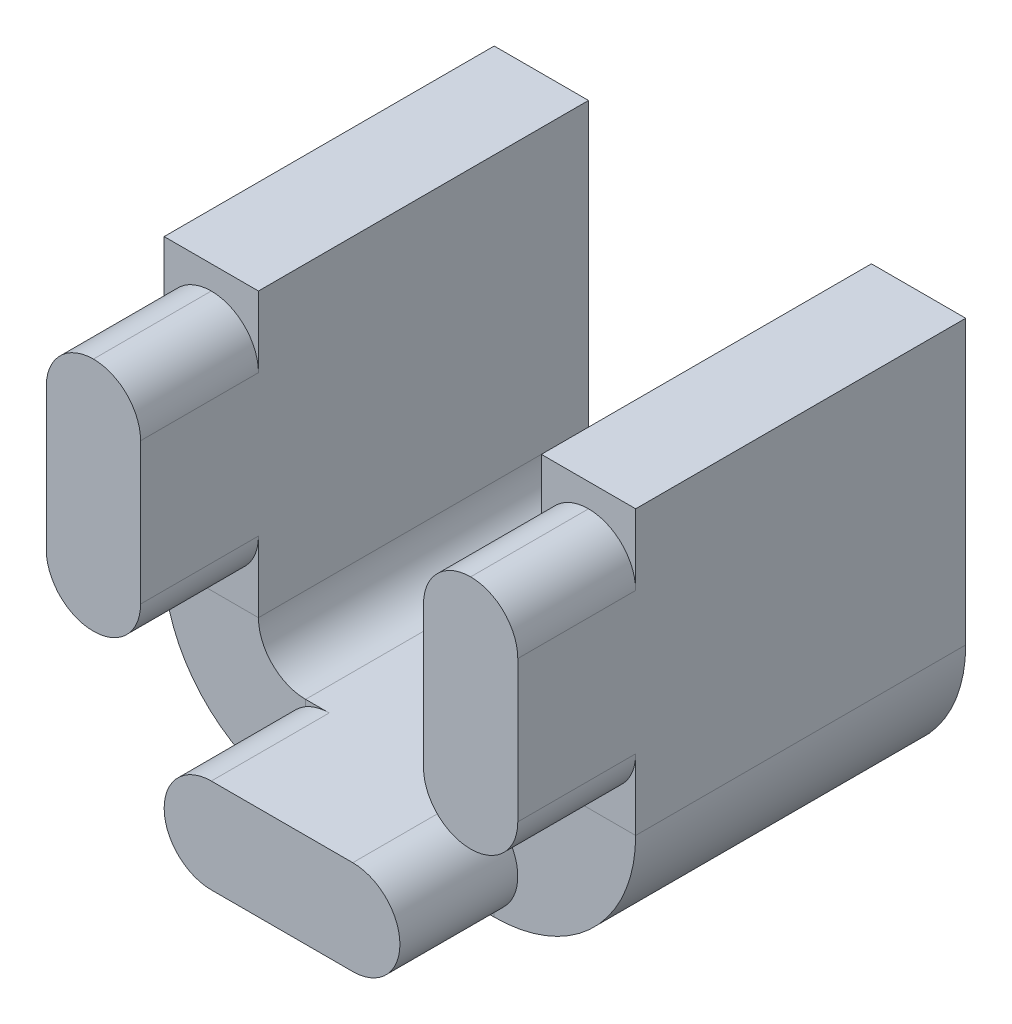
ISO-10303-21;
HEADER;
FILE_DESCRIPTION(('STEP AP214'),'2;1');
FILE_NAME('part.step','',(''),(''),'','','');
FILE_SCHEMA(('AUTOMOTIVE_DESIGN { 1 0 10303 214 1 1 1 1 }'));
ENDSEC;
DATA;
#1=APPLICATION_CONTEXT('core data for automotive mechanical design processes');
#2=APPLICATION_PROTOCOL_DEFINITION('international standard','automotive_design',2000,#1);
#3=PRODUCT_CONTEXT('',#1,'mechanical');
#4=PRODUCT('Part','Part','',(#3));
#5=PRODUCT_RELATED_PRODUCT_CATEGORY('part','',(#4));
#6=PRODUCT_DEFINITION_FORMATION('','',#4);
#7=PRODUCT_DEFINITION_CONTEXT('part definition',#1,'design');
#8=PRODUCT_DEFINITION('design','',#6,#7);
#9=PRODUCT_DEFINITION_SHAPE('','',#8);
#10=(LENGTH_UNIT() NAMED_UNIT(*) SI_UNIT(.MILLI.,.METRE.));
#11=(NAMED_UNIT(*) PLANE_ANGLE_UNIT() SI_UNIT($,.RADIAN.));
#12=(NAMED_UNIT(*) SI_UNIT($,.STERADIAN.) SOLID_ANGLE_UNIT());
#13=UNCERTAINTY_MEASURE_WITH_UNIT(LENGTH_MEASURE(1.E-05),#10,'distance_accuracy_value','');
#14=(GEOMETRIC_REPRESENTATION_CONTEXT(3) GLOBAL_UNCERTAINTY_ASSIGNED_CONTEXT((#13)) GLOBAL_UNIT_ASSIGNED_CONTEXT((#10,
#11,#12)) REPRESENTATION_CONTEXT('',''));
#15=CARTESIAN_POINT('',(0.,0.,0.));
#16=DIRECTION('',(0.,0.,1.));
#17=DIRECTION('',(1.,0.,0.));
#18=AXIS2_PLACEMENT_3D('',#15,#16,#17);
#19=CARTESIAN_POINT('',(-3.,0.,3.5));
#20=DIRECTION('',(0.,-1.,0.));
#21=DIRECTION('',(0.,0.,-1.));
#22=AXIS2_PLACEMENT_3D('',#19,#20,#21);
#23=PLANE('',#22);
#24=DIRECTION('',(0.,0.,-1.));
#25=VECTOR('',#24,1.);
#26=CARTESIAN_POINT('',(-2.00000000000002,0.,-3.5));
#27=LINE('',#26,#25);
#28=CARTESIAN_POINT('',(-2.00000000000002,0.,3.5));
#29=VERTEX_POINT('',#28);
#30=CARTESIAN_POINT('',(-2.00000000000002,0.,-3.5));
#31=VERTEX_POINT('',#30);
#32=EDGE_CURVE('E330',#29,#31,#27,.T.);
#33=ORIENTED_EDGE('',*,*,#32,.F.);
#34=DIRECTION('',(-1.,0.,0.));
#35=VECTOR('',#34,1.);
#36=CARTESIAN_POINT('',(-3.,0.,3.5));
#37=LINE('',#36,#35);
#38=CARTESIAN_POINT('',(-1.5,0.,3.5));
#39=VERTEX_POINT('',#38);
#40=EDGE_CURVE('E326',#39,#29,#37,.T.);
#41=ORIENTED_EDGE('',*,*,#40,.F.);
#42=DIRECTION('',(0.,0.,-1.));
#43=VECTOR('',#42,1.);
#44=CARTESIAN_POINT('',(-1.5,0.,6.));
#45=LINE('',#44,#43);
#46=CARTESIAN_POINT('',(-1.5,0.,6.));
#47=VERTEX_POINT('',#46);
#48=EDGE_CURVE('E664',#47,#39,#45,.T.);
#49=ORIENTED_EDGE('',*,*,#48,.F.);
#50=DIRECTION('',(-1.,0.,0.));
#51=VECTOR('',#50,1.);
#52=CARTESIAN_POINT('',(1.5,0.,6.));
#53=LINE('',#52,#51);
#54=CARTESIAN_POINT('',(1.5,0.,6.));
#55=VERTEX_POINT('',#54);
#56=EDGE_CURVE('E259',#55,#47,#53,.T.);
#57=ORIENTED_EDGE('',*,*,#56,.F.);
#58=DIRECTION('',(0.,0.,-1.));
#59=VECTOR('',#58,1.);
#60=CARTESIAN_POINT('',(1.5,0.,6.));
#61=LINE('',#60,#59);
#62=CARTESIAN_POINT('',(1.5,0.,3.5));
#63=VERTEX_POINT('',#62);
#64=EDGE_CURVE('E271',#55,#63,#61,.T.);
#65=ORIENTED_EDGE('',*,*,#64,.T.);
#66=CARTESIAN_POINT('',(2.00000000000002,0.,3.5));
#67=VERTEX_POINT('',#66);
#68=EDGE_CURVE('E327',#67,#63,#37,.T.);
#69=ORIENTED_EDGE('',*,*,#68,.F.);
#70=DIRECTION('',(0.,0.,1.));
#71=VECTOR('',#70,1.);
#72=CARTESIAN_POINT('',(2.00000000000002,0.,3.5));
#73=LINE('',#72,#71);
#74=CARTESIAN_POINT('',(2.00000000000002,0.,-3.5));
#75=VERTEX_POINT('',#74);
#76=EDGE_CURVE('E346',#75,#67,#73,.T.);
#77=ORIENTED_EDGE('',*,*,#76,.F.);
#78=DIRECTION('',(-1.,0.,0.));
#79=VECTOR('',#78,1.);
#80=CARTESIAN_POINT('',(-3.,0.,-3.5));
#81=LINE('',#80,#79);
#82=EDGE_CURVE('E323',#75,#31,#81,.T.);
#83=ORIENTED_EDGE('',*,*,#82,.T.);
#84=EDGE_LOOP('',(#33,#41,#49,#57,#65,#69,#77,#83));
#85=FACE_BOUND('',#84,.T.);
#86=CARTESIAN_POINT('',(0.,0.,0.));
#87=DIRECTION('',(0.,-1.,0.));
#88=DIRECTION('',(0.,0.,-1.));
#89=AXIS2_PLACEMENT_3D('',#86,#87,#88);
#90=CIRCLE('',#89,1.75);
#91=CARTESIAN_POINT('',(0.,0.,-1.75));
#92=VERTEX_POINT('',#91);
#93=EDGE_CURVE('E12',#92,#92,#90,.F.);
#94=ORIENTED_EDGE('',*,*,#93,.F.);
#95=EDGE_LOOP('',(#94));
#96=FACE_BOUND('',#95,.T.);
#97=ADVANCED_FACE('F44',(#85,#96),#23,.F.);
#98=CARTESIAN_POINT('',(-3.,16.1245154965971,3.5));
#99=DIRECTION('',(0.,0.,1.));
#100=DIRECTION('',(1.,0.,0.));
#101=AXIS2_PLACEMENT_3D('',#98,#99,#100);
#102=PLANE('',#101);
#103=DIRECTION('',(1.,0.,0.));
#104=VECTOR('',#103,1.);
#105=CARTESIAN_POINT('',(-3.,-2.,3.5));
#106=LINE('',#105,#104);
#107=CARTESIAN_POINT('',(-1.5,-2.,3.5));
#108=VERTEX_POINT('',#107);
#109=CARTESIAN_POINT('',(-2.00000000000002,-2.,3.5));
#110=VERTEX_POINT('',#109);
#111=EDGE_CURVE('E317',#108,#110,#106,.F.);
#112=ORIENTED_EDGE('',*,*,#111,.F.);
#113=CARTESIAN_POINT('',(-1.5,-1.,3.5));
#114=DIRECTION('',(0.,0.,1.));
#115=DIRECTION('',(-1.,0.,0.));
#116=AXIS2_PLACEMENT_3D('',#113,#114,#115);
#117=CIRCLE('',#116,1.);
#118=CARTESIAN_POINT('',(-2.00000000000002,-1.86602540378443,3.5));
#119=VERTEX_POINT('',#118);
#120=EDGE_CURVE('E265',#119,#108,#117,.T.);
#121=ORIENTED_EDGE('',*,*,#120,.F.);
#122=DIRECTION('',(0.,-1.,0.));
#123=VECTOR('',#122,1.);
#124=CARTESIAN_POINT('',(-2.00000000000002,16.1245154965971,3.5));
#125=LINE('',#124,#123);
#126=EDGE_CURVE('E340',#119,#110,#125,.T.);
#127=ORIENTED_EDGE('',*,*,#126,.T.);
#128=EDGE_LOOP('',(#112,#121,#127));
#129=FACE_BOUND('',#128,.T.);
#130=ADVANCED_FACE('F565',(#129),#102,.T.);
#131=CARTESIAN_POINT('',(-2.00000000000002,-0.133974596215571,3.5));
#132=VERTEX_POINT('',#131);
#133=EDGE_CURVE('E341',#29,#132,#125,.T.);
#134=ORIENTED_EDGE('',*,*,#133,.T.);
#135=EDGE_CURVE('E59',#39,#132,#117,.T.);
#136=ORIENTED_EDGE('',*,*,#135,.F.);
#137=ORIENTED_EDGE('',*,*,#40,.T.);
#138=EDGE_LOOP('',(#134,#136,#137));
#139=FACE_BOUND('',#138,.T.);
#140=ADVANCED_FACE('F570',(#139),#102,.T.);
#141=DIRECTION('',(0.,-1.,0.));
#142=VECTOR('',#141,1.);
#143=CARTESIAN_POINT('',(2.00000000000002,16.1245154965971,3.5));
#144=LINE('',#143,#142);
#145=CARTESIAN_POINT('',(2.00000000000002,-1.86602540378443,3.5));
#146=VERTEX_POINT('',#145);
#147=CARTESIAN_POINT('',(2.00000000000002,-2.,3.5));
#148=VERTEX_POINT('',#147);
#149=EDGE_CURVE('E336',#146,#148,#144,.T.);
#150=ORIENTED_EDGE('',*,*,#149,.F.);
#151=CARTESIAN_POINT('',(1.5,-1.,3.5));
#152=DIRECTION('',(0.,0.,1.));
#153=DIRECTION('',(1.,0.,0.));
#154=AXIS2_PLACEMENT_3D('',#151,#152,#153);
#155=CIRCLE('',#154,1.);
#156=CARTESIAN_POINT('',(1.5,-2.,3.5));
#157=VERTEX_POINT('',#156);
#158=EDGE_CURVE('E261',#157,#146,#155,.T.);
#159=ORIENTED_EDGE('',*,*,#158,.F.);
#160=EDGE_CURVE('E318',#148,#157,#106,.F.);
#161=ORIENTED_EDGE('',*,*,#160,.F.);
#162=EDGE_LOOP('',(#150,#159,#161));
#163=FACE_BOUND('',#162,.T.);
#164=ADVANCED_FACE('F491',(#163),#102,.T.);
#165=ORIENTED_EDGE('',*,*,#68,.T.);
#166=CARTESIAN_POINT('',(2.00000000000002,-0.133974596215571,3.5));
#167=VERTEX_POINT('',#166);
#168=EDGE_CURVE('E669',#167,#63,#155,.T.);
#169=ORIENTED_EDGE('',*,*,#168,.F.);
#170=EDGE_CURVE('E337',#67,#167,#144,.T.);
#171=ORIENTED_EDGE('',*,*,#170,.F.);
#172=EDGE_LOOP('',(#165,#169,#171));
#173=FACE_BOUND('',#172,.T.);
#174=ADVANCED_FACE('F573',(#173),#102,.T.);
#175=CARTESIAN_POINT('',(2.00000000000002,0.999999999999983,3.5));
#176=DIRECTION('',(0.,0.,1.));
#177=DIRECTION('',(1.,0.,0.));
#178=AXIS2_PLACEMENT_3D('',#175,#176,#177);
#179=PLANE('',#178);
#180=ORIENTED_EDGE('',*,*,#170,.T.);
#181=CARTESIAN_POINT('',(1.5,-1.,3.5));
#182=DIRECTION('',(0.,0.,1.));
#183=DIRECTION('',(1.,0.,0.));
#184=AXIS2_PLACEMENT_3D('',#181,#182,#183);
#185=CIRCLE('',#184,1.);
#186=EDGE_CURVE('E52',#167,#146,#185,.F.);
#187=ORIENTED_EDGE('',*,*,#186,.T.);
#188=ORIENTED_EDGE('',*,*,#149,.T.);
#189=CARTESIAN_POINT('',(2.00000000000002,0.999999999999983,3.5));
#190=DIRECTION('',(0.,0.,-1.));
#191=DIRECTION('',(-1.,0.,0.));
#192=AXIS2_PLACEMENT_3D('',#189,#190,#191);
#193=CIRCLE('',#192,2.99999999999998);
#194=CARTESIAN_POINT('',(5.,0.999999999999984,3.5));
#195=VERTEX_POINT('',#194);
#196=EDGE_CURVE('E304',#195,#148,#193,.T.);
#197=ORIENTED_EDGE('',*,*,#196,.F.);
#198=DIRECTION('',(1.,0.,0.));
#199=VECTOR('',#198,1.);
#200=CARTESIAN_POINT('',(-15.4390889145858,0.999999999999982,3.5));
#201=LINE('',#200,#199);
#202=CARTESIAN_POINT('',(3.,0.999999999999981,3.5));
#203=VERTEX_POINT('',#202);
#204=EDGE_CURVE('E371',#203,#195,#201,.T.);
#205=ORIENTED_EDGE('',*,*,#204,.F.);
#206=CARTESIAN_POINT('',(2.00000000000002,0.999999999999983,3.5));
#207=DIRECTION('',(0.,0.,-1.));
#208=DIRECTION('',(-1.,0.,0.));
#209=AXIS2_PLACEMENT_3D('',#206,#207,#208);
#210=CIRCLE('',#209,0.999999999999983);
#211=EDGE_CURVE('E300',#203,#67,#210,.T.);
#212=ORIENTED_EDGE('',*,*,#211,.T.);
#213=EDGE_LOOP('',(#180,#187,#188,#197,#205,#212));
#214=FACE_BOUND('',#213,.T.);
#215=ADVANCED_FACE('F483',(#214),#179,.T.);
#216=CARTESIAN_POINT('',(-2.00000000000002,0.999999999999983,3.5));
#217=DIRECTION('',(0.,0.,1.));
#218=DIRECTION('',(1.,0.,0.));
#219=AXIS2_PLACEMENT_3D('',#216,#217,#218);
#220=PLANE('',#219);
#221=ORIENTED_EDGE('',*,*,#126,.F.);
#222=CARTESIAN_POINT('',(-1.5,-1.,3.5));
#223=DIRECTION('',(0.,0.,1.));
#224=DIRECTION('',(1.,0.,0.));
#225=AXIS2_PLACEMENT_3D('',#222,#223,#224);
#226=CIRCLE('',#225,1.);
#227=EDGE_CURVE('E477',#119,#132,#226,.F.);
#228=ORIENTED_EDGE('',*,*,#227,.T.);
#229=ORIENTED_EDGE('',*,*,#133,.F.);
#230=CARTESIAN_POINT('',(-2.00000000000002,0.999999999999983,3.5));
#231=DIRECTION('',(0.,0.,1.));
#232=DIRECTION('',(1.,0.,0.));
#233=AXIS2_PLACEMENT_3D('',#230,#231,#232);
#234=CIRCLE('',#233,0.999999999999983);
#235=CARTESIAN_POINT('',(-3.,0.999999999999983,3.5));
#236=VERTEX_POINT('',#235);
#237=EDGE_CURVE('E297',#29,#236,#234,.F.);
#238=ORIENTED_EDGE('',*,*,#237,.T.);
#239=DIRECTION('',(-1.,0.,0.));
#240=VECTOR('',#239,1.);
#241=CARTESIAN_POINT('',(15.4390889145858,0.999999999999982,3.5));
#242=LINE('',#241,#240);
#243=CARTESIAN_POINT('',(-5.,0.999999999999983,3.5));
#244=VERTEX_POINT('',#243);
#245=EDGE_CURVE('E355',#236,#244,#242,.T.);
#246=ORIENTED_EDGE('',*,*,#245,.T.);
#247=CARTESIAN_POINT('',(-2.00000000000002,0.999999999999983,3.5));
#248=DIRECTION('',(0.,0.,1.));
#249=DIRECTION('',(1.,0.,0.));
#250=AXIS2_PLACEMENT_3D('',#247,#248,#249);
#251=CIRCLE('',#250,2.99999999999998);
#252=EDGE_CURVE('E296',#110,#244,#251,.F.);
#253=ORIENTED_EDGE('',*,*,#252,.F.);
#254=EDGE_LOOP('',(#221,#228,#229,#238,#246,#253));
#255=FACE_BOUND('',#254,.T.);
#256=ADVANCED_FACE('F660',(#255),#220,.T.);
#257=CARTESIAN_POINT('',(-15.4390889145858,0.,3.5));
#258=DIRECTION('',(0.,0.,1.));
#259=DIRECTION('',(0.,1.,0.));
#260=AXIS2_PLACEMENT_3D('',#257,#258,#259);
#261=PLANE('',#260);
#262=CARTESIAN_POINT('',(4.,2.5,3.5));
#263=DIRECTION('',(0.,0.,1.));
#264=DIRECTION('',(1.,0.,0.));
#265=AXIS2_PLACEMENT_3D('',#262,#263,#264);
#266=CIRCLE('',#265,1.);
#267=CARTESIAN_POINT('',(5.,2.5,3.5));
#268=VERTEX_POINT('',#267);
#269=CARTESIAN_POINT('',(4.,1.5,3.5));
#270=VERTEX_POINT('',#269);
#271=EDGE_CURVE('E67',#268,#270,#266,.F.);
#272=ORIENTED_EDGE('',*,*,#271,.T.);
#273=CARTESIAN_POINT('',(4.,2.5,3.5));
#274=DIRECTION('',(0.,0.,1.));
#275=DIRECTION('',(1.,0.,0.));
#276=AXIS2_PLACEMENT_3D('',#273,#274,#275);
#277=CIRCLE('',#276,1.);
#278=CARTESIAN_POINT('',(3.,2.5,3.5));
#279=VERTEX_POINT('',#278);
#280=EDGE_CURVE('E472',#270,#279,#277,.F.);
#281=ORIENTED_EDGE('',*,*,#280,.T.);
#282=DIRECTION('',(0.,-1.,0.));
#283=VECTOR('',#282,1.);
#284=CARTESIAN_POINT('',(3.,0.,3.5));
#285=LINE('',#284,#283);
#286=EDGE_CURVE('E370',#279,#203,#285,.T.);
#287=ORIENTED_EDGE('',*,*,#286,.T.);
#288=ORIENTED_EDGE('',*,*,#204,.T.);
#289=DIRECTION('',(0.,1.,0.));
#290=VECTOR('',#289,1.);
#291=CARTESIAN_POINT('',(5.,0.,3.5));
#292=LINE('',#291,#290);
#293=EDGE_CURVE('E367',#268,#195,#292,.F.);
#294=ORIENTED_EDGE('',*,*,#293,.F.);
#295=EDGE_LOOP('',(#272,#281,#287,#288,#294));
#296=FACE_BOUND('',#295,.T.);
#297=ADVANCED_FACE('F520',(#296),#261,.T.);
#298=CARTESIAN_POINT('',(15.4390889145858,0.,3.5));
#299=DIRECTION('',(0.,0.,1.));
#300=DIRECTION('',(0.,-1.,0.));
#301=AXIS2_PLACEMENT_3D('',#298,#299,#300);
#302=PLANE('',#301);
#303=DIRECTION('',(0.,-1.,0.));
#304=VECTOR('',#303,1.);
#305=CARTESIAN_POINT('',(-5.,0.,3.5));
#306=LINE('',#305,#304);
#307=CARTESIAN_POINT('',(-5.,7.,3.5));
#308=VERTEX_POINT('',#307);
#309=CARTESIAN_POINT('',(-5.,5.5,3.5));
#310=VERTEX_POINT('',#309);
#311=EDGE_CURVE('E395',#308,#310,#306,.T.);
#312=ORIENTED_EDGE('',*,*,#311,.T.);
#313=CARTESIAN_POINT('',(-4.,5.5,3.5));
#314=DIRECTION('',(0.,0.,1.));
#315=DIRECTION('',(1.,0.,0.));
#316=AXIS2_PLACEMENT_3D('',#313,#314,#315);
#317=CIRCLE('',#316,1.);
#318=CARTESIAN_POINT('',(-4.,6.5,3.5));
#319=VERTEX_POINT('',#318);
#320=EDGE_CURVE('E445',#310,#319,#317,.F.);
#321=ORIENTED_EDGE('',*,*,#320,.T.);
#322=CARTESIAN_POINT('',(-4.,5.5,3.5));
#323=DIRECTION('',(0.,0.,1.));
#324=DIRECTION('',(1.,0.,0.));
#325=AXIS2_PLACEMENT_3D('',#322,#323,#324);
#326=CIRCLE('',#325,1.);
#327=CARTESIAN_POINT('',(-3.,5.5,3.5));
#328=VERTEX_POINT('',#327);
#329=EDGE_CURVE('E442',#319,#328,#326,.F.);
#330=ORIENTED_EDGE('',*,*,#329,.T.);
#331=DIRECTION('',(0.,-1.,0.));
#332=VECTOR('',#331,1.);
#333=CARTESIAN_POINT('',(-3.,0.,3.5));
#334=LINE('',#333,#332);
#335=CARTESIAN_POINT('',(-3.,7.,3.5));
#336=VERTEX_POINT('',#335);
#337=EDGE_CURVE('E392',#336,#328,#334,.T.);
#338=ORIENTED_EDGE('',*,*,#337,.F.);
#339=DIRECTION('',(-1.,0.,0.));
#340=VECTOR('',#339,1.);
#341=CARTESIAN_POINT('',(15.4390889145858,7.,3.5));
#342=LINE('',#341,#340);
#343=EDGE_CURVE('E398',#336,#308,#342,.T.);
#344=ORIENTED_EDGE('',*,*,#343,.T.);
#345=EDGE_LOOP('',(#312,#321,#330,#338,#344));
#346=FACE_BOUND('',#345,.T.);
#347=ADVANCED_FACE('F608',(#346),#302,.T.);
#348=CARTESIAN_POINT('',(-3.,-2.,3.5));
#349=DIRECTION('',(0.,-1.,0.));
#350=DIRECTION('',(0.,0.,-1.));
#351=AXIS2_PLACEMENT_3D('',#348,#349,#350);
#352=PLANE('',#351);
#353=ORIENTED_EDGE('',*,*,#160,.T.);
#354=DIRECTION('',(0.,0.,-1.));
#355=VECTOR('',#354,1.);
#356=CARTESIAN_POINT('',(1.5,-2.,6.));
#357=LINE('',#356,#355);
#358=CARTESIAN_POINT('',(1.5,-2.,6.));
#359=VERTEX_POINT('',#358);
#360=EDGE_CURVE('E250',#359,#157,#357,.T.);
#361=ORIENTED_EDGE('',*,*,#360,.F.);
#362=DIRECTION('',(1.,0.,0.));
#363=VECTOR('',#362,1.);
#364=CARTESIAN_POINT('',(-1.5,-2.,6.));
#365=LINE('',#364,#363);
#366=CARTESIAN_POINT('',(-1.5,-2.,6.));
#367=VERTEX_POINT('',#366);
#368=EDGE_CURVE('E242',#367,#359,#365,.T.);
#369=ORIENTED_EDGE('',*,*,#368,.F.);
#370=DIRECTION('',(0.,0.,-1.));
#371=VECTOR('',#370,1.);
#372=CARTESIAN_POINT('',(-1.5,-2.,6.));
#373=LINE('',#372,#371);
#374=EDGE_CURVE('E248',#367,#108,#373,.T.);
#375=ORIENTED_EDGE('',*,*,#374,.T.);
#376=ORIENTED_EDGE('',*,*,#111,.T.);
#377=DIRECTION('',(0.,0.,-1.));
#378=VECTOR('',#377,1.);
#379=CARTESIAN_POINT('',(-2.00000000000002,-2.,-3.5));
#380=LINE('',#379,#378);
#381=CARTESIAN_POINT('',(-2.00000000000002,-2.,-3.5));
#382=VERTEX_POINT('',#381);
#383=EDGE_CURVE('E320',#110,#382,#380,.T.);
#384=ORIENTED_EDGE('',*,*,#383,.T.);
#385=DIRECTION('',(1.,0.,0.));
#386=VECTOR('',#385,1.);
#387=CARTESIAN_POINT('',(-3.,-2.,-3.5));
#388=LINE('',#387,#386);
#389=CARTESIAN_POINT('',(2.00000000000002,-2.,-3.5));
#390=VERTEX_POINT('',#389);
#391=EDGE_CURVE('E311',#390,#382,#388,.F.);
#392=ORIENTED_EDGE('',*,*,#391,.F.);
#393=DIRECTION('',(0.,0.,1.));
#394=VECTOR('',#393,1.);
#395=CARTESIAN_POINT('',(2.00000000000002,-2.,3.5));
#396=LINE('',#395,#394);
#397=EDGE_CURVE('E349',#390,#148,#396,.T.);
#398=ORIENTED_EDGE('',*,*,#397,.T.);
#399=EDGE_LOOP('',(#353,#361,#369,#375,#376,#384,#392,#398));
#400=FACE_BOUND('',#399,.T.);
#401=CARTESIAN_POINT('',(0.,-2.,0.));
#402=DIRECTION('',(0.,-1.,0.));
#403=DIRECTION('',(0.,0.,-1.));
#404=AXIS2_PLACEMENT_3D('',#401,#402,#403);
#405=CIRCLE('',#404,1.5);
#406=CARTESIAN_POINT('',(0.,-2.,-1.5));
#407=VERTEX_POINT('',#406);
#408=EDGE_CURVE('E285',#407,#407,#405,.F.);
#409=ORIENTED_EDGE('',*,*,#408,.T.);
#410=EDGE_LOOP('',(#409));
#411=FACE_BOUND('',#410,.T.);
#412=ADVANCED_FACE('F245',(#400,#411),#352,.T.);
#413=CARTESIAN_POINT('',(15.4390889145858,7.,3.5));
#414=DIRECTION('',(0.,1.,0.));
#415=DIRECTION('',(-1.,0.,0.));
#416=AXIS2_PLACEMENT_3D('',#413,#414,#415);
#417=PLANE('',#416);
#418=DIRECTION('',(-1.,0.,0.));
#419=VECTOR('',#418,1.);
#420=CARTESIAN_POINT('',(15.4390889145858,7.,-3.5));
#421=LINE('',#420,#419);
#422=CARTESIAN_POINT('',(-3.,7.,-3.5));
#423=VERTEX_POINT('',#422);
#424=CARTESIAN_POINT('',(-5.,7.,-3.5));
#425=VERTEX_POINT('',#424);
#426=EDGE_CURVE('E410',#423,#425,#421,.T.);
#427=ORIENTED_EDGE('',*,*,#426,.T.);
#428=DIRECTION('',(0.,0.,-1.));
#429=VECTOR('',#428,1.);
#430=CARTESIAN_POINT('',(-5.,7.,3.5));
#431=LINE('',#430,#429);
#432=EDGE_CURVE('E401',#308,#425,#431,.T.);
#433=ORIENTED_EDGE('',*,*,#432,.F.);
#434=ORIENTED_EDGE('',*,*,#343,.F.);
#435=DIRECTION('',(0.,0.,-1.));
#436=VECTOR('',#435,1.);
#437=CARTESIAN_POINT('',(-3.,7.,3.5));
#438=LINE('',#437,#436);
#439=EDGE_CURVE('E408',#336,#423,#438,.T.);
#440=ORIENTED_EDGE('',*,*,#439,.T.);
#441=EDGE_LOOP('',(#427,#433,#434,#440));
#442=FACE_BOUND('',#441,.T.);
#443=ADVANCED_FACE('F592',(#442),#417,.T.);
#444=CARTESIAN_POINT('',(15.4390889145858,0.,-3.5));
#445=DIRECTION('',(0.,0.,1.));
#446=DIRECTION('',(0.,-1.,0.));
#447=AXIS2_PLACEMENT_3D('',#444,#445,#446);
#448=PLANE('',#447);
#449=DIRECTION('',(0.,1.,0.));
#450=VECTOR('',#449,1.);
#451=CARTESIAN_POINT('',(-5.,0.,-3.5));
#452=LINE('',#451,#450);
#453=CARTESIAN_POINT('',(-5.,0.999999999999984,-3.5));
#454=VERTEX_POINT('',#453);
#455=EDGE_CURVE('E405',#454,#425,#452,.T.);
#456=ORIENTED_EDGE('',*,*,#455,.T.);
#457=ORIENTED_EDGE('',*,*,#426,.F.);
#458=DIRECTION('',(0.,1.,0.));
#459=VECTOR('',#458,1.);
#460=CARTESIAN_POINT('',(-3.,0.,-3.5));
#461=LINE('',#460,#459);
#462=CARTESIAN_POINT('',(-3.,0.999999999999982,-3.5));
#463=VERTEX_POINT('',#462);
#464=EDGE_CURVE('E385',#463,#423,#461,.T.);
#465=ORIENTED_EDGE('',*,*,#464,.F.);
#466=DIRECTION('',(-1.,0.,0.));
#467=VECTOR('',#466,1.);
#468=CARTESIAN_POINT('',(15.4390889145858,0.999999999999982,-3.5));
#469=LINE('',#468,#467);
#470=EDGE_CURVE('E403',#463,#454,#469,.T.);
#471=ORIENTED_EDGE('',*,*,#470,.T.);
#472=EDGE_LOOP('',(#456,#457,#465,#471));
#473=FACE_BOUND('',#472,.T.);
#474=ADVANCED_FACE('F595',(#473),#448,.F.);
#475=CARTESIAN_POINT('',(-5.,0.,3.5));
#476=DIRECTION('',(-1.,0.,0.));
#477=DIRECTION('',(0.,0.,1.));
#478=AXIS2_PLACEMENT_3D('',#475,#476,#477);
#479=PLANE('',#478);
#480=CARTESIAN_POINT('',(-5.,2.5,3.5));
#481=VERTEX_POINT('',#480);
#482=EDGE_CURVE('E397',#481,#244,#306,.T.);
#483=ORIENTED_EDGE('',*,*,#482,.F.);
#484=DIRECTION('',(0.,0.,1.));
#485=VECTOR('',#484,1.);
#486=CARTESIAN_POINT('',(-5.,2.5,3.5));
#487=LINE('',#486,#485);
#488=CARTESIAN_POINT('',(-5.,2.5,6.));
#489=VERTEX_POINT('',#488);
#490=EDGE_CURVE('E420',#481,#489,#487,.T.);
#491=ORIENTED_EDGE('',*,*,#490,.T.);
#492=DIRECTION('',(0.,1.,0.));
#493=VECTOR('',#492,1.);
#494=CARTESIAN_POINT('',(-5.,6.5,6.));
#495=LINE('',#494,#493);
#496=CARTESIAN_POINT('',(-5.,5.5,6.));
#497=VERTEX_POINT('',#496);
#498=EDGE_CURVE('E286',#489,#497,#495,.T.);
#499=ORIENTED_EDGE('',*,*,#498,.T.);
#500=DIRECTION('',(0.,0.,-1.));
#501=VECTOR('',#500,1.);
#502=CARTESIAN_POINT('',(-5.,5.5,3.5));
#503=LINE('',#502,#501);
#504=EDGE_CURVE('E388',#497,#310,#503,.T.);
#505=ORIENTED_EDGE('',*,*,#504,.T.);
#506=ORIENTED_EDGE('',*,*,#311,.F.);
#507=ORIENTED_EDGE('',*,*,#432,.T.);
#508=ORIENTED_EDGE('',*,*,#455,.F.);
#509=DIRECTION('',(0.,0.,-1.));
#510=VECTOR('',#509,1.);
#511=CARTESIAN_POINT('',(-5.,0.999999999999982,-3.5));
#512=LINE('',#511,#510);
#513=EDGE_CURVE('E413',#244,#454,#512,.T.);
#514=ORIENTED_EDGE('',*,*,#513,.F.);
#515=EDGE_LOOP('',(#483,#491,#499,#505,#506,#507,#508,#514));
#516=FACE_BOUND('',#515,.T.);
#517=ADVANCED_FACE('F599',(#516),#479,.T.);
#518=CARTESIAN_POINT('',(-3.,2.5,3.5));
#519=VERTEX_POINT('',#518);
#520=EDGE_CURVE('E394',#519,#236,#334,.T.);
#521=ORIENTED_EDGE('',*,*,#520,.F.);
#522=CARTESIAN_POINT('',(-4.,2.5,3.5));
#523=DIRECTION('',(0.,0.,1.));
#524=DIRECTION('',(1.,0.,0.));
#525=AXIS2_PLACEMENT_3D('',#522,#523,#524);
#526=CIRCLE('',#525,1.);
#527=CARTESIAN_POINT('',(-4.,1.5,3.5));
#528=VERTEX_POINT('',#527);
#529=EDGE_CURVE('E440',#519,#528,#526,.F.);
#530=ORIENTED_EDGE('',*,*,#529,.T.);
#531=CARTESIAN_POINT('',(-4.,2.5,3.5));
#532=DIRECTION('',(0.,0.,1.));
#533=DIRECTION('',(1.,0.,0.));
#534=AXIS2_PLACEMENT_3D('',#531,#532,#533);
#535=CIRCLE('',#534,1.);
#536=EDGE_CURVE('E437',#528,#481,#535,.F.);
#537=ORIENTED_EDGE('',*,*,#536,.T.);
#538=ORIENTED_EDGE('',*,*,#482,.T.);
#539=ORIENTED_EDGE('',*,*,#245,.F.);
#540=EDGE_LOOP('',(#521,#530,#537,#538,#539));
#541=FACE_BOUND('',#540,.T.);
#542=ADVANCED_FACE('F603',(#541),#302,.T.);
#543=CARTESIAN_POINT('',(-3.,0.,3.5));
#544=DIRECTION('',(-1.,0.,0.));
#545=DIRECTION('',(0.,0.,1.));
#546=AXIS2_PLACEMENT_3D('',#543,#544,#545);
#547=PLANE('',#546);
#548=DIRECTION('',(0.,1.,0.));
#549=VECTOR('',#548,1.);
#550=CARTESIAN_POINT('',(-3.,6.5,6.));
#551=LINE('',#550,#549);
#552=CARTESIAN_POINT('',(-3.,2.5,6.));
#553=VERTEX_POINT('',#552);
#554=CARTESIAN_POINT('',(-3.,5.5,6.));
#555=VERTEX_POINT('',#554);
#556=EDGE_CURVE('E282',#553,#555,#551,.T.);
#557=ORIENTED_EDGE('',*,*,#556,.F.);
#558=DIRECTION('',(0.,0.,1.));
#559=VECTOR('',#558,1.);
#560=CARTESIAN_POINT('',(-3.,2.5,3.5));
#561=LINE('',#560,#559);
#562=EDGE_CURVE('E434',#553,#519,#561,.F.);
#563=ORIENTED_EDGE('',*,*,#562,.T.);
#564=ORIENTED_EDGE('',*,*,#520,.T.);
#565=DIRECTION('',(0.,0.,-1.));
#566=VECTOR('',#565,1.);
#567=CARTESIAN_POINT('',(-3.,0.999999999999982,-3.5));
#568=LINE('',#567,#566);
#569=EDGE_CURVE('E389',#236,#463,#568,.T.);
#570=ORIENTED_EDGE('',*,*,#569,.T.);
#571=ORIENTED_EDGE('',*,*,#464,.T.);
#572=ORIENTED_EDGE('',*,*,#439,.F.);
#573=ORIENTED_EDGE('',*,*,#337,.T.);
#574=DIRECTION('',(0.,0.,-1.));
#575=VECTOR('',#574,1.);
#576=CARTESIAN_POINT('',(-3.,5.5,6.));
#577=LINE('',#576,#575);
#578=EDGE_CURVE('E431',#328,#555,#577,.F.);
#579=ORIENTED_EDGE('',*,*,#578,.T.);
#580=EDGE_LOOP('',(#557,#563,#564,#570,#571,#572,#573,#579));
#581=FACE_BOUND('',#580,.T.);
#582=ADVANCED_FACE('F581',(#581),#547,.F.);
#583=CARTESIAN_POINT('',(-15.4390889145858,7.,3.5));
#584=DIRECTION('',(0.,-1.,0.));
#585=DIRECTION('',(1.,0.,0.));
#586=AXIS2_PLACEMENT_3D('',#583,#584,#585);
#587=PLANE('',#586);
#588=DIRECTION('',(0.,0.,-1.));
#589=VECTOR('',#588,1.);
#590=CARTESIAN_POINT('',(5.,7.,3.5));
#591=LINE('',#590,#589);
#592=CARTESIAN_POINT('',(5.,7.,3.5));
#593=VERTEX_POINT('',#592);
#594=CARTESIAN_POINT('',(5.,7.,-3.5));
#595=VERTEX_POINT('',#594);
#596=EDGE_CURVE('E377',#593,#595,#591,.T.);
#597=ORIENTED_EDGE('',*,*,#596,.T.);
#598=DIRECTION('',(1.,0.,0.));
#599=VECTOR('',#598,1.);
#600=CARTESIAN_POINT('',(-15.4390889145858,7.,-3.5));
#601=LINE('',#600,#599);
#602=CARTESIAN_POINT('',(3.,7.,-3.5));
#603=VERTEX_POINT('',#602);
#604=EDGE_CURVE('E361',#603,#595,#601,.T.);
#605=ORIENTED_EDGE('',*,*,#604,.F.);
#606=DIRECTION('',(0.,0.,-1.));
#607=VECTOR('',#606,1.);
#608=CARTESIAN_POINT('',(3.,7.,3.5));
#609=LINE('',#608,#607);
#610=CARTESIAN_POINT('',(3.,7.,3.5));
#611=VERTEX_POINT('',#610);
#612=EDGE_CURVE('E353',#611,#603,#609,.T.);
#613=ORIENTED_EDGE('',*,*,#612,.F.);
#614=DIRECTION('',(1.,0.,0.));
#615=VECTOR('',#614,1.);
#616=CARTESIAN_POINT('',(-15.4390889145858,7.,3.5));
#617=LINE('',#616,#615);
#618=EDGE_CURVE('E374',#611,#593,#617,.T.);
#619=ORIENTED_EDGE('',*,*,#618,.T.);
#620=EDGE_LOOP('',(#597,#605,#613,#619));
#621=FACE_BOUND('',#620,.T.);
#622=ADVANCED_FACE('F549',(#621),#587,.F.);
#623=CARTESIAN_POINT('',(4.,5.5,3.5));
#624=DIRECTION('',(0.,0.,1.));
#625=DIRECTION('',(1.,0.,0.));
#626=AXIS2_PLACEMENT_3D('',#623,#624,#625);
#627=CIRCLE('',#626,1.);
#628=CARTESIAN_POINT('',(3.,5.5,3.5));
#629=VERTEX_POINT('',#628);
#630=CARTESIAN_POINT('',(4.,6.5,3.5));
#631=VERTEX_POINT('',#630);
#632=EDGE_CURVE('E469',#629,#631,#627,.F.);
#633=ORIENTED_EDGE('',*,*,#632,.T.);
#634=CARTESIAN_POINT('',(4.,5.5,3.5));
#635=DIRECTION('',(0.,0.,1.));
#636=DIRECTION('',(1.,0.,0.));
#637=AXIS2_PLACEMENT_3D('',#634,#635,#636);
#638=CIRCLE('',#637,1.);
#639=CARTESIAN_POINT('',(5.,5.5,3.5));
#640=VERTEX_POINT('',#639);
#641=EDGE_CURVE('E474',#631,#640,#638,.F.);
#642=ORIENTED_EDGE('',*,*,#641,.T.);
#643=EDGE_CURVE('E365',#593,#640,#292,.F.);
#644=ORIENTED_EDGE('',*,*,#643,.F.);
#645=ORIENTED_EDGE('',*,*,#618,.F.);
#646=EDGE_CURVE('E368',#611,#629,#285,.T.);
#647=ORIENTED_EDGE('',*,*,#646,.T.);
#648=EDGE_LOOP('',(#633,#642,#644,#645,#647));
#649=FACE_BOUND('',#648,.T.);
#650=ADVANCED_FACE('F550',(#649),#261,.T.);
#651=CARTESIAN_POINT('',(5.,0.,3.5));
#652=DIRECTION('',(1.,0.,0.));
#653=DIRECTION('',(0.,0.,-1.));
#654=AXIS2_PLACEMENT_3D('',#651,#652,#653);
#655=PLANE('',#654);
#656=DIRECTION('',(0.,-1.,0.));
#657=VECTOR('',#656,1.);
#658=CARTESIAN_POINT('',(5.,6.5,6.));
#659=LINE('',#658,#657);
#660=CARTESIAN_POINT('',(5.,5.5,6.));
#661=VERTEX_POINT('',#660);
#662=CARTESIAN_POINT('',(5.,2.5,6.));
#663=VERTEX_POINT('',#662);
#664=EDGE_CURVE('E279',#661,#663,#659,.T.);
#665=ORIENTED_EDGE('',*,*,#664,.T.);
#666=DIRECTION('',(0.,0.,-1.));
#667=VECTOR('',#666,1.);
#668=CARTESIAN_POINT('',(5.,2.5,3.5));
#669=LINE('',#668,#667);
#670=EDGE_CURVE('E466',#663,#268,#669,.T.);
#671=ORIENTED_EDGE('',*,*,#670,.T.);
#672=ORIENTED_EDGE('',*,*,#293,.T.);
#673=DIRECTION('',(0.,0.,1.));
#674=VECTOR('',#673,1.);
#675=CARTESIAN_POINT('',(5.,0.999999999999982,3.5));
#676=LINE('',#675,#674);
#677=CARTESIAN_POINT('',(5.,0.999999999999983,-3.5));
#678=VERTEX_POINT('',#677);
#679=EDGE_CURVE('E380',#678,#195,#676,.T.);
#680=ORIENTED_EDGE('',*,*,#679,.F.);
#681=DIRECTION('',(0.,1.,0.));
#682=VECTOR('',#681,1.);
#683=CARTESIAN_POINT('',(5.,0.,-3.5));
#684=LINE('',#683,#682);
#685=EDGE_CURVE('E363',#595,#678,#684,.F.);
#686=ORIENTED_EDGE('',*,*,#685,.F.);
#687=ORIENTED_EDGE('',*,*,#596,.F.);
#688=ORIENTED_EDGE('',*,*,#643,.T.);
#689=DIRECTION('',(0.,0.,1.));
#690=VECTOR('',#689,1.);
#691=CARTESIAN_POINT('',(5.,5.5,3.5));
#692=LINE('',#691,#690);
#693=EDGE_CURVE('E464',#640,#661,#692,.T.);
#694=ORIENTED_EDGE('',*,*,#693,.T.);
#695=EDGE_LOOP('',(#665,#671,#672,#680,#686,#687,#688,#694));
#696=FACE_BOUND('',#695,.T.);
#697=ADVANCED_FACE('F524',(#696),#655,.T.);
#698=CARTESIAN_POINT('',(-15.4390889145858,0.,-3.5));
#699=DIRECTION('',(0.,0.,1.));
#700=DIRECTION('',(0.,1.,0.));
#701=AXIS2_PLACEMENT_3D('',#698,#699,#700);
#702=PLANE('',#701);
#703=ORIENTED_EDGE('',*,*,#685,.T.);
#704=DIRECTION('',(1.,0.,0.));
#705=VECTOR('',#704,1.);
#706=CARTESIAN_POINT('',(-15.4390889145858,0.999999999999982,-3.5));
#707=LINE('',#706,#705);
#708=CARTESIAN_POINT('',(3.,0.999999999999983,-3.5));
#709=VERTEX_POINT('',#708);
#710=EDGE_CURVE('E352',#709,#678,#707,.T.);
#711=ORIENTED_EDGE('',*,*,#710,.F.);
#712=DIRECTION('',(0.,-1.,0.));
#713=VECTOR('',#712,1.);
#714=CARTESIAN_POINT('',(3.,0.,-3.5));
#715=LINE('',#714,#713);
#716=EDGE_CURVE('E359',#603,#709,#715,.T.);
#717=ORIENTED_EDGE('',*,*,#716,.F.);
#718=ORIENTED_EDGE('',*,*,#604,.T.);
#719=EDGE_LOOP('',(#703,#711,#717,#718));
#720=FACE_BOUND('',#719,.T.);
#721=ADVANCED_FACE('F586',(#720),#702,.F.);
#722=CARTESIAN_POINT('',(3.,0.,3.5));
#723=DIRECTION('',(1.,0.,0.));
#724=DIRECTION('',(0.,0.,-1.));
#725=AXIS2_PLACEMENT_3D('',#722,#723,#724);
#726=PLANE('',#725);
#727=DIRECTION('',(0.,-1.,0.));
#728=VECTOR('',#727,1.);
#729=CARTESIAN_POINT('',(3.,6.5,6.));
#730=LINE('',#729,#728);
#731=CARTESIAN_POINT('',(3.,5.5,6.));
#732=VERTEX_POINT('',#731);
#733=CARTESIAN_POINT('',(3.,2.5,6.));
#734=VERTEX_POINT('',#733);
#735=EDGE_CURVE('E275',#732,#734,#730,.T.);
#736=ORIENTED_EDGE('',*,*,#735,.F.);
#737=DIRECTION('',(0.,0.,1.));
#738=VECTOR('',#737,1.);
#739=CARTESIAN_POINT('',(3.,5.5,3.5));
#740=LINE('',#739,#738);
#741=EDGE_CURVE('E461',#732,#629,#740,.F.);
#742=ORIENTED_EDGE('',*,*,#741,.T.);
#743=ORIENTED_EDGE('',*,*,#646,.F.);
#744=ORIENTED_EDGE('',*,*,#612,.T.);
#745=ORIENTED_EDGE('',*,*,#716,.T.);
#746=DIRECTION('',(0.,0.,1.));
#747=VECTOR('',#746,1.);
#748=CARTESIAN_POINT('',(3.,0.999999999999982,3.5));
#749=LINE('',#748,#747);
#750=EDGE_CURVE('E356',#709,#203,#749,.T.);
#751=ORIENTED_EDGE('',*,*,#750,.T.);
#752=ORIENTED_EDGE('',*,*,#286,.F.);
#753=DIRECTION('',(0.,0.,-1.));
#754=VECTOR('',#753,1.);
#755=CARTESIAN_POINT('',(3.,2.5,6.));
#756=LINE('',#755,#754);
#757=EDGE_CURVE('E459',#279,#734,#756,.F.);
#758=ORIENTED_EDGE('',*,*,#757,.T.);
#759=EDGE_LOOP('',(#736,#742,#743,#744,#745,#751,#752,#758));
#760=FACE_BOUND('',#759,.T.);
#761=ADVANCED_FACE('F518',(#760),#726,.F.);
#762=CARTESIAN_POINT('',(-3.,16.1245154965971,-3.5));
#763=DIRECTION('',(0.,0.,1.));
#764=DIRECTION('',(1.,0.,0.));
#765=AXIS2_PLACEMENT_3D('',#762,#763,#764);
#766=PLANE('',#765);
#767=ORIENTED_EDGE('',*,*,#391,.T.);
#768=DIRECTION('',(0.,-1.,0.));
#769=VECTOR('',#768,1.);
#770=CARTESIAN_POINT('',(-2.00000000000002,16.1245154965971,-3.5));
#771=LINE('',#770,#769);
#772=EDGE_CURVE('E344',#31,#382,#771,.T.);
#773=ORIENTED_EDGE('',*,*,#772,.F.);
#774=ORIENTED_EDGE('',*,*,#82,.F.);
#775=DIRECTION('',(0.,-1.,0.));
#776=VECTOR('',#775,1.);
#777=CARTESIAN_POINT('',(2.00000000000002,16.1245154965971,-3.5));
#778=LINE('',#777,#776);
#779=EDGE_CURVE('E333',#75,#390,#778,.T.);
#780=ORIENTED_EDGE('',*,*,#779,.T.);
#781=EDGE_LOOP('',(#767,#773,#774,#780));
#782=FACE_BOUND('',#781,.T.);
#783=ADVANCED_FACE('F502',(#782),#766,.F.);
#784=CARTESIAN_POINT('',(2.00000000000002,0.999999999999983,-3.5));
#785=DIRECTION('',(0.,0.,-1.));
#786=DIRECTION('',(-1.,0.,0.));
#787=AXIS2_PLACEMENT_3D('',#784,#785,#786);
#788=PLANE('',#787);
#789=CARTESIAN_POINT('',(2.00000000000002,0.999999999999983,-3.5));
#790=DIRECTION('',(0.,0.,-1.));
#791=DIRECTION('',(-1.,0.,0.));
#792=AXIS2_PLACEMENT_3D('',#789,#790,#791);
#793=CIRCLE('',#792,0.999999999999983);
#794=EDGE_CURVE('E308',#75,#709,#793,.F.);
#795=ORIENTED_EDGE('',*,*,#794,.T.);
#796=ORIENTED_EDGE('',*,*,#710,.T.);
#797=CARTESIAN_POINT('',(2.00000000000002,0.999999999999983,-3.5));
#798=DIRECTION('',(0.,0.,-1.));
#799=DIRECTION('',(-1.,0.,0.));
#800=AXIS2_PLACEMENT_3D('',#797,#798,#799);
#801=CIRCLE('',#800,2.99999999999998);
#802=EDGE_CURVE('E307',#390,#678,#801,.F.);
#803=ORIENTED_EDGE('',*,*,#802,.F.);
#804=ORIENTED_EDGE('',*,*,#779,.F.);
#805=EDGE_LOOP('',(#795,#796,#803,#804));
#806=FACE_BOUND('',#805,.T.);
#807=ADVANCED_FACE('F497',(#806),#788,.T.);
#808=CARTESIAN_POINT('',(2.00000000000002,0.999999999999983,26.9422769251219));
#809=DIRECTION('',(0.,0.,-1.));
#810=DIRECTION('',(-1.,0.,0.));
#811=AXIS2_PLACEMENT_3D('',#808,#809,#810);
#812=CYLINDRICAL_SURFACE('',#811,2.99999999999998);
#813=ORIENTED_EDGE('',*,*,#397,.F.);
#814=ORIENTED_EDGE('',*,*,#802,.T.);
#815=ORIENTED_EDGE('',*,*,#679,.T.);
#816=ORIENTED_EDGE('',*,*,#196,.T.);
#817=EDGE_LOOP('',(#813,#814,#815,#816));
#818=FACE_BOUND('',#817,.T.);
#819=ADVANCED_FACE('F495',(#818),#812,.T.);
#820=CARTESIAN_POINT('',(2.00000000000002,0.999999999999983,26.9422769251219));
#821=DIRECTION('',(0.,0.,-1.));
#822=DIRECTION('',(-1.,0.,0.));
#823=AXIS2_PLACEMENT_3D('',#820,#821,#822);
#824=CYLINDRICAL_SURFACE('',#823,0.999999999999983);
#825=ORIENTED_EDGE('',*,*,#76,.T.);
#826=ORIENTED_EDGE('',*,*,#211,.F.);
#827=ORIENTED_EDGE('',*,*,#750,.F.);
#828=ORIENTED_EDGE('',*,*,#794,.F.);
#829=EDGE_LOOP('',(#825,#826,#827,#828));
#830=FACE_BOUND('',#829,.T.);
#831=ADVANCED_FACE('F513',(#830),#824,.F.);
#832=CARTESIAN_POINT('',(-2.00000000000002,0.999999999999983,-3.5));
#833=DIRECTION('',(0.,0.,-1.));
#834=DIRECTION('',(-1.,0.,0.));
#835=AXIS2_PLACEMENT_3D('',#832,#833,#834);
#836=PLANE('',#835);
#837=ORIENTED_EDGE('',*,*,#470,.F.);
#838=CARTESIAN_POINT('',(-2.00000000000002,0.999999999999983,-3.5));
#839=DIRECTION('',(0.,0.,1.));
#840=DIRECTION('',(1.,0.,0.));
#841=AXIS2_PLACEMENT_3D('',#838,#839,#840);
#842=CIRCLE('',#841,0.999999999999983);
#843=EDGE_CURVE('E292',#463,#31,#842,.T.);
#844=ORIENTED_EDGE('',*,*,#843,.T.);
#845=ORIENTED_EDGE('',*,*,#772,.T.);
#846=CARTESIAN_POINT('',(-2.00000000000002,0.999999999999983,-3.5));
#847=DIRECTION('',(0.,0.,1.));
#848=DIRECTION('',(1.,0.,0.));
#849=AXIS2_PLACEMENT_3D('',#846,#847,#848);
#850=CIRCLE('',#849,2.99999999999998);
#851=EDGE_CURVE('E293',#454,#382,#850,.T.);
#852=ORIENTED_EDGE('',*,*,#851,.F.);
#853=EDGE_LOOP('',(#837,#844,#845,#852));
#854=FACE_BOUND('',#853,.T.);
#855=ADVANCED_FACE('F652',(#854),#836,.T.);
#856=CARTESIAN_POINT('',(-2.00000000000002,0.999999999999983,-23.2623635578952));
#857=DIRECTION('',(0.,0.,1.));
#858=DIRECTION('',(1.,0.,0.));
#859=AXIS2_PLACEMENT_3D('',#856,#857,#858);
#860=CYLINDRICAL_SURFACE('',#859,2.99999999999998);
#861=ORIENTED_EDGE('',*,*,#383,.F.);
#862=ORIENTED_EDGE('',*,*,#252,.T.);
#863=ORIENTED_EDGE('',*,*,#513,.T.);
#864=ORIENTED_EDGE('',*,*,#851,.T.);
#865=EDGE_LOOP('',(#861,#862,#863,#864));
#866=FACE_BOUND('',#865,.T.);
#867=ADVANCED_FACE('F704',(#866),#860,.T.);
#868=CARTESIAN_POINT('',(-2.00000000000002,0.999999999999983,-23.2623635578952));
#869=DIRECTION('',(0.,0.,1.));
#870=DIRECTION('',(1.,0.,0.));
#871=AXIS2_PLACEMENT_3D('',#868,#869,#870);
#872=CYLINDRICAL_SURFACE('',#871,0.999999999999983);
#873=ORIENTED_EDGE('',*,*,#32,.T.);
#874=ORIENTED_EDGE('',*,*,#843,.F.);
#875=ORIENTED_EDGE('',*,*,#569,.F.);
#876=ORIENTED_EDGE('',*,*,#237,.F.);
#877=EDGE_LOOP('',(#873,#874,#875,#876));
#878=FACE_BOUND('',#877,.T.);
#879=ADVANCED_FACE('F655',(#878),#872,.F.);
#880=CARTESIAN_POINT('',(0.,-2.,0.));
#881=DIRECTION('',(0.,-1.,0.));
#882=DIRECTION('',(0.,0.,-1.));
#883=AXIS2_PLACEMENT_3D('',#880,#881,#882);
#884=CYLINDRICAL_SURFACE('',#883,1.5);
#885=ORIENTED_EDGE('',*,*,#408,.F.);
#886=EDGE_LOOP('',(#885));
#887=FACE_BOUND('',#886,.T.);
#888=CARTESIAN_POINT('',(0.,1.,0.));
#889=DIRECTION('',(0.,1.,0.));
#890=DIRECTION('',(0.,0.,1.));
#891=AXIS2_PLACEMENT_3D('',#888,#889,#890);
#892=CIRCLE('',#891,1.5);
#893=CARTESIAN_POINT('',(0.,1.,1.5));
#894=VERTEX_POINT('',#893);
#895=EDGE_CURVE('E675',#894,#894,#892,.T.);
#896=ORIENTED_EDGE('',*,*,#895,.T.);
#897=EDGE_LOOP('',(#896));
#898=FACE_BOUND('',#897,.T.);
#899=ADVANCED_FACE('F679',(#887,#898),#884,.F.);
#900=CARTESIAN_POINT('',(-3.,6.5,6.));
#901=DIRECTION('',(0.,0.,1.));
#902=DIRECTION('',(0.,-1.,0.));
#903=AXIS2_PLACEMENT_3D('',#900,#901,#902);
#904=PLANE('',#903);
#905=ORIENTED_EDGE('',*,*,#498,.F.);
#906=CARTESIAN_POINT('',(-4.,2.5,6.));
#907=DIRECTION('',(0.,0.,1.));
#908=DIRECTION('',(0.,-1.,0.));
#909=AXIS2_PLACEMENT_3D('',#906,#907,#908);
#910=CIRCLE('',#909,1.);
#911=CARTESIAN_POINT('',(-4.,1.5,6.));
#912=VERTEX_POINT('',#911);
#913=EDGE_CURVE('E429',#489,#912,#910,.T.);
#914=ORIENTED_EDGE('',*,*,#913,.T.);
#915=CARTESIAN_POINT('',(-4.,2.5,6.));
#916=DIRECTION('',(0.,0.,1.));
#917=DIRECTION('',(0.,-1.,0.));
#918=AXIS2_PLACEMENT_3D('',#915,#916,#917);
#919=CIRCLE('',#918,1.);
#920=EDGE_CURVE('E427',#912,#553,#919,.T.);
#921=ORIENTED_EDGE('',*,*,#920,.T.);
#922=ORIENTED_EDGE('',*,*,#556,.T.);
#923=CARTESIAN_POINT('',(-4.,5.5,6.));
#924=DIRECTION('',(0.,0.,1.));
#925=DIRECTION('',(0.,-1.,0.));
#926=AXIS2_PLACEMENT_3D('',#923,#924,#925);
#927=CIRCLE('',#926,1.);
#928=CARTESIAN_POINT('',(-4.,6.5,6.));
#929=VERTEX_POINT('',#928);
#930=EDGE_CURVE('E425',#555,#929,#927,.T.);
#931=ORIENTED_EDGE('',*,*,#930,.T.);
#932=CARTESIAN_POINT('',(-4.,5.5,6.));
#933=DIRECTION('',(0.,0.,1.));
#934=DIRECTION('',(0.,-1.,0.));
#935=AXIS2_PLACEMENT_3D('',#932,#933,#934);
#936=CIRCLE('',#935,1.);
#937=EDGE_CURVE('E423',#929,#497,#936,.T.);
#938=ORIENTED_EDGE('',*,*,#937,.T.);
#939=EDGE_LOOP('',(#905,#914,#921,#922,#931,#938));
#940=FACE_BOUND('',#939,.T.);
#941=ADVANCED_FACE('F620',(#940),#904,.T.);
#942=CARTESIAN_POINT('',(-4.,2.5,3.5));
#943=DIRECTION('',(0.,0.,-1.));
#944=DIRECTION('',(-1.,0.,0.));
#945=AXIS2_PLACEMENT_3D('',#942,#943,#944);
#946=CYLINDRICAL_SURFACE('',#945,1.);
#947=DIRECTION('',(0.,0.,1.));
#948=VECTOR('',#947,1.);
#949=CARTESIAN_POINT('',(-4.,1.5,6.));
#950=LINE('',#949,#948);
#951=EDGE_CURVE('E289',#528,#912,#950,.T.);
#952=ORIENTED_EDGE('',*,*,#951,.F.);
#953=ORIENTED_EDGE('',*,*,#529,.F.);
#954=ORIENTED_EDGE('',*,*,#562,.F.);
#955=ORIENTED_EDGE('',*,*,#920,.F.);
#956=EDGE_LOOP('',(#952,#953,#954,#955));
#957=FACE_BOUND('',#956,.T.);
#958=ADVANCED_FACE('F616',(#957),#946,.T.);
#959=CARTESIAN_POINT('',(-4.,2.5,3.5));
#960=DIRECTION('',(0.,0.,1.));
#961=DIRECTION('',(1.,0.,0.));
#962=AXIS2_PLACEMENT_3D('',#959,#960,#961);
#963=CYLINDRICAL_SURFACE('',#962,1.);
#964=ORIENTED_EDGE('',*,*,#536,.F.);
#965=ORIENTED_EDGE('',*,*,#951,.T.);
#966=ORIENTED_EDGE('',*,*,#913,.F.);
#967=ORIENTED_EDGE('',*,*,#490,.F.);
#968=EDGE_LOOP('',(#964,#965,#966,#967));
#969=FACE_BOUND('',#968,.T.);
#970=ADVANCED_FACE('F612',(#969),#963,.T.);
#971=CARTESIAN_POINT('',(-4.,5.5,3.5));
#972=DIRECTION('',(0.,0.,-1.));
#973=DIRECTION('',(-1.,0.,0.));
#974=AXIS2_PLACEMENT_3D('',#971,#972,#973);
#975=CYLINDRICAL_SURFACE('',#974,1.);
#976=ORIENTED_EDGE('',*,*,#504,.F.);
#977=ORIENTED_EDGE('',*,*,#937,.F.);
#978=DIRECTION('',(0.,0.,-1.));
#979=VECTOR('',#978,1.);
#980=CARTESIAN_POINT('',(-4.,6.5,3.5));
#981=LINE('',#980,#979);
#982=EDGE_CURVE('E278',#319,#929,#981,.F.);
#983=ORIENTED_EDGE('',*,*,#982,.F.);
#984=ORIENTED_EDGE('',*,*,#320,.F.);
#985=EDGE_LOOP('',(#976,#977,#983,#984));
#986=FACE_BOUND('',#985,.T.);
#987=ADVANCED_FACE('F615',(#986),#975,.T.);
#988=CARTESIAN_POINT('',(-4.,5.5,3.5));
#989=DIRECTION('',(0.,0.,1.));
#990=DIRECTION('',(1.,0.,0.));
#991=AXIS2_PLACEMENT_3D('',#988,#989,#990);
#992=CYLINDRICAL_SURFACE('',#991,1.);
#993=ORIENTED_EDGE('',*,*,#930,.F.);
#994=ORIENTED_EDGE('',*,*,#578,.F.);
#995=ORIENTED_EDGE('',*,*,#329,.F.);
#996=ORIENTED_EDGE('',*,*,#982,.T.);
#997=EDGE_LOOP('',(#993,#994,#995,#996));
#998=FACE_BOUND('',#997,.T.);
#999=ADVANCED_FACE('F562',(#998),#992,.T.);
#1000=CARTESIAN_POINT('',(3.,6.5,6.));
#1001=DIRECTION('',(0.,0.,1.));
#1002=DIRECTION('',(1.,0.,0.));
#1003=AXIS2_PLACEMENT_3D('',#1000,#1001,#1002);
#1004=PLANE('',#1003);
#1005=CARTESIAN_POINT('',(4.,2.5,6.));
#1006=DIRECTION('',(0.,0.,1.));
#1007=DIRECTION('',(1.,0.,0.));
#1008=AXIS2_PLACEMENT_3D('',#1005,#1006,#1007);
#1009=CIRCLE('',#1008,1.);
#1010=CARTESIAN_POINT('',(4.,1.5,6.));
#1011=VERTEX_POINT('',#1010);
#1012=EDGE_CURVE('E455',#734,#1011,#1009,.T.);
#1013=ORIENTED_EDGE('',*,*,#1012,.T.);
#1014=CARTESIAN_POINT('',(4.,2.5,6.));
#1015=DIRECTION('',(0.,0.,1.));
#1016=DIRECTION('',(1.,0.,0.));
#1017=AXIS2_PLACEMENT_3D('',#1014,#1015,#1016);
#1018=CIRCLE('',#1017,1.);
#1019=EDGE_CURVE('E457',#1011,#663,#1018,.T.);
#1020=ORIENTED_EDGE('',*,*,#1019,.T.);
#1021=ORIENTED_EDGE('',*,*,#664,.F.);
#1022=CARTESIAN_POINT('',(4.,5.5,6.));
#1023=DIRECTION('',(0.,0.,1.));
#1024=DIRECTION('',(1.,0.,0.));
#1025=AXIS2_PLACEMENT_3D('',#1022,#1023,#1024);
#1026=CIRCLE('',#1025,1.);
#1027=CARTESIAN_POINT('',(4.,6.5,6.));
#1028=VERTEX_POINT('',#1027);
#1029=EDGE_CURVE('E447',#661,#1028,#1026,.T.);
#1030=ORIENTED_EDGE('',*,*,#1029,.T.);
#1031=CARTESIAN_POINT('',(4.,5.5,6.));
#1032=DIRECTION('',(0.,0.,1.));
#1033=DIRECTION('',(1.,0.,0.));
#1034=AXIS2_PLACEMENT_3D('',#1031,#1032,#1033);
#1035=CIRCLE('',#1034,1.);
#1036=EDGE_CURVE('E453',#1028,#732,#1035,.T.);
#1037=ORIENTED_EDGE('',*,*,#1036,.T.);
#1038=ORIENTED_EDGE('',*,*,#735,.T.);
#1039=EDGE_LOOP('',(#1013,#1020,#1021,#1030,#1037,#1038));
#1040=FACE_BOUND('',#1039,.T.);
#1041=ADVANCED_FACE('F537',(#1040),#1004,.T.);
#1042=CARTESIAN_POINT('',(4.,5.5,3.5));
#1043=DIRECTION('',(0.,0.,1.));
#1044=DIRECTION('',(1.,0.,0.));
#1045=AXIS2_PLACEMENT_3D('',#1042,#1043,#1044);
#1046=CYLINDRICAL_SURFACE('',#1045,1.);
#1047=ORIENTED_EDGE('',*,*,#693,.F.);
#1048=ORIENTED_EDGE('',*,*,#641,.F.);
#1049=DIRECTION('',(0.,0.,1.));
#1050=VECTOR('',#1049,1.);
#1051=CARTESIAN_POINT('',(4.,6.5,3.5));
#1052=LINE('',#1051,#1050);
#1053=EDGE_CURVE('E269',#1028,#631,#1052,.F.);
#1054=ORIENTED_EDGE('',*,*,#1053,.F.);
#1055=ORIENTED_EDGE('',*,*,#1029,.F.);
#1056=EDGE_LOOP('',(#1047,#1048,#1054,#1055));
#1057=FACE_BOUND('',#1056,.T.);
#1058=ADVANCED_FACE('F554',(#1057),#1046,.T.);
#1059=CARTESIAN_POINT('',(4.,5.5,3.5));
#1060=DIRECTION('',(0.,0.,-1.));
#1061=DIRECTION('',(-1.,0.,0.));
#1062=AXIS2_PLACEMENT_3D('',#1059,#1060,#1061);
#1063=CYLINDRICAL_SURFACE('',#1062,1.);
#1064=ORIENTED_EDGE('',*,*,#632,.F.);
#1065=ORIENTED_EDGE('',*,*,#741,.F.);
#1066=ORIENTED_EDGE('',*,*,#1036,.F.);
#1067=ORIENTED_EDGE('',*,*,#1053,.T.);
#1068=EDGE_LOOP('',(#1064,#1065,#1066,#1067));
#1069=FACE_BOUND('',#1068,.T.);
#1070=ADVANCED_FACE('F543',(#1069),#1063,.T.);
#1071=CARTESIAN_POINT('',(4.,2.5,3.5));
#1072=DIRECTION('',(0.,0.,1.));
#1073=DIRECTION('',(1.,0.,0.));
#1074=AXIS2_PLACEMENT_3D('',#1071,#1072,#1073);
#1075=CYLINDRICAL_SURFACE('',#1074,1.);
#1076=DIRECTION('',(0.,0.,-1.));
#1077=VECTOR('',#1076,1.);
#1078=CARTESIAN_POINT('',(4.,1.5,3.5));
#1079=LINE('',#1078,#1077);
#1080=EDGE_CURVE('E266',#1011,#270,#1079,.T.);
#1081=ORIENTED_EDGE('',*,*,#1080,.F.);
#1082=ORIENTED_EDGE('',*,*,#1012,.F.);
#1083=ORIENTED_EDGE('',*,*,#757,.F.);
#1084=ORIENTED_EDGE('',*,*,#280,.F.);
#1085=EDGE_LOOP('',(#1081,#1082,#1083,#1084));
#1086=FACE_BOUND('',#1085,.T.);
#1087=ADVANCED_FACE('F46',(#1086),#1075,.T.);
#1088=CARTESIAN_POINT('',(4.,2.5,3.5));
#1089=DIRECTION('',(0.,0.,-1.));
#1090=DIRECTION('',(-1.,0.,0.));
#1091=AXIS2_PLACEMENT_3D('',#1088,#1089,#1090);
#1092=CYLINDRICAL_SURFACE('',#1091,1.);
#1093=ORIENTED_EDGE('',*,*,#1019,.F.);
#1094=ORIENTED_EDGE('',*,*,#1080,.T.);
#1095=ORIENTED_EDGE('',*,*,#271,.F.);
#1096=ORIENTED_EDGE('',*,*,#670,.F.);
#1097=EDGE_LOOP('',(#1093,#1094,#1095,#1096));
#1098=FACE_BOUND('',#1097,.T.);
#1099=ADVANCED_FACE('F530',(#1098),#1092,.T.);
#1100=CARTESIAN_POINT('',(-1.5,-1.,6.));
#1101=DIRECTION('',(0.,0.,-1.));
#1102=DIRECTION('',(-1.,0.,0.));
#1103=AXIS2_PLACEMENT_3D('',#1100,#1101,#1102);
#1104=CYLINDRICAL_SURFACE('',#1103,1.);
#1105=ORIENTED_EDGE('',*,*,#135,.T.);
#1106=ORIENTED_EDGE('',*,*,#227,.F.);
#1107=ORIENTED_EDGE('',*,*,#120,.T.);
#1108=ORIENTED_EDGE('',*,*,#374,.F.);
#1109=CARTESIAN_POINT('',(-1.5,-1.,6.));
#1110=DIRECTION('',(0.,0.,1.));
#1111=DIRECTION('',(-1.,0.,0.));
#1112=AXIS2_PLACEMENT_3D('',#1109,#1110,#1111);
#1113=CIRCLE('',#1112,1.);
#1114=EDGE_CURVE('E254',#47,#367,#1113,.T.);
#1115=ORIENTED_EDGE('',*,*,#1114,.F.);
#1116=ORIENTED_EDGE('',*,*,#48,.T.);
#1117=EDGE_LOOP('',(#1105,#1106,#1107,#1108,#1115,#1116));
#1118=FACE_BOUND('',#1117,.T.);
#1119=ADVANCED_FACE('F263',(#1118),#1104,.T.);
#1120=CARTESIAN_POINT('',(1.5,-1.,6.));
#1121=DIRECTION('',(0.,0.,-1.));
#1122=DIRECTION('',(-1.,0.,0.));
#1123=AXIS2_PLACEMENT_3D('',#1120,#1121,#1122);
#1124=CYLINDRICAL_SURFACE('',#1123,1.);
#1125=ORIENTED_EDGE('',*,*,#158,.T.);
#1126=ORIENTED_EDGE('',*,*,#186,.F.);
#1127=ORIENTED_EDGE('',*,*,#168,.T.);
#1128=ORIENTED_EDGE('',*,*,#64,.F.);
#1129=CARTESIAN_POINT('',(1.5,-1.,6.));
#1130=DIRECTION('',(0.,0.,1.));
#1131=DIRECTION('',(1.,0.,0.));
#1132=AXIS2_PLACEMENT_3D('',#1129,#1130,#1131);
#1133=CIRCLE('',#1132,1.);
#1134=EDGE_CURVE('E253',#359,#55,#1133,.T.);
#1135=ORIENTED_EDGE('',*,*,#1134,.F.);
#1136=ORIENTED_EDGE('',*,*,#360,.T.);
#1137=EDGE_LOOP('',(#1125,#1126,#1127,#1128,#1135,#1136));
#1138=FACE_BOUND('',#1137,.T.);
#1139=ADVANCED_FACE('F692',(#1138),#1124,.T.);
#1140=CARTESIAN_POINT('',(-1.5,-1.,6.));
#1141=DIRECTION('',(0.,0.,-1.));
#1142=DIRECTION('',(-1.,0.,0.));
#1143=AXIS2_PLACEMENT_3D('',#1140,#1141,#1142);
#1144=PLANE('',#1143);
#1145=ORIENTED_EDGE('',*,*,#1114,.T.);
#1146=ORIENTED_EDGE('',*,*,#368,.T.);
#1147=ORIENTED_EDGE('',*,*,#1134,.T.);
#1148=ORIENTED_EDGE('',*,*,#56,.T.);
#1149=EDGE_LOOP('',(#1145,#1146,#1147,#1148));
#1150=FACE_BOUND('',#1149,.T.);
#1151=ADVANCED_FACE('F257',(#1150),#1144,.F.);
#1152=CARTESIAN_POINT('',(0.,1.,0.));
#1153=DIRECTION('',(0.,1.,0.));
#1154=DIRECTION('',(0.,0.,1.));
#1155=AXIS2_PLACEMENT_3D('',#1152,#1153,#1154);
#1156=PLANE('',#1155);
#1157=CARTESIAN_POINT('',(0.,1.,0.));
#1158=DIRECTION('',(0.,1.,0.));
#1159=DIRECTION('',(1.,0.,0.));
#1160=AXIS2_PLACEMENT_3D('',#1157,#1158,#1159);
#1161=CIRCLE('',#1160,1.75);
#1162=CARTESIAN_POINT('',(1.75,1.,0.));
#1163=VERTEX_POINT('',#1162);
#1164=EDGE_CURVE('E672',#1163,#1163,#1161,.T.);
#1165=ORIENTED_EDGE('',*,*,#1164,.T.);
#1166=EDGE_LOOP('',(#1165));
#1167=FACE_BOUND('',#1166,.T.);
#1168=ORIENTED_EDGE('',*,*,#895,.F.);
#1169=EDGE_LOOP('',(#1168));
#1170=FACE_BOUND('',#1169,.T.);
#1171=ADVANCED_FACE('F681',(#1167,#1170),#1156,.T.);
#1172=CARTESIAN_POINT('',(0.,1.,0.));
#1173=DIRECTION('',(0.,-1.,0.));
#1174=DIRECTION('',(0.,0.,-1.));
#1175=AXIS2_PLACEMENT_3D('',#1172,#1173,#1174);
#1176=CYLINDRICAL_SURFACE('',#1175,1.75);
#1177=ORIENTED_EDGE('',*,*,#1164,.F.);
#1178=EDGE_LOOP('',(#1177));
#1179=FACE_BOUND('',#1178,.T.);
#1180=ORIENTED_EDGE('',*,*,#93,.T.);
#1181=EDGE_LOOP('',(#1180));
#1182=FACE_BOUND('',#1181,.T.);
#1183=ADVANCED_FACE('F683',(#1179,#1182),#1176,.T.);
#1184=CLOSED_SHELL('',(#97,#130,#140,#164,#174,#215,#256,#297,#347,#412,#443,#474,#517,#542,
#582,#622,#650,#697,#721,#761,#783,#807,#819,#831,#855,#867,#879,#899,#941,#958,#970,#987,#999,
#1041,#1058,#1070,#1087,#1099,#1119,#1139,#1151,#1171,#1183));
#1185=MANIFOLD_SOLID_BREP('B2',#1184);
#1186=ADVANCED_BREP_SHAPE_REPRESENTATION('',(#18,#1185),#14);
#1187=SHAPE_DEFINITION_REPRESENTATION(#9,#1186);
ENDSEC;
END-ISO-10303-21;
